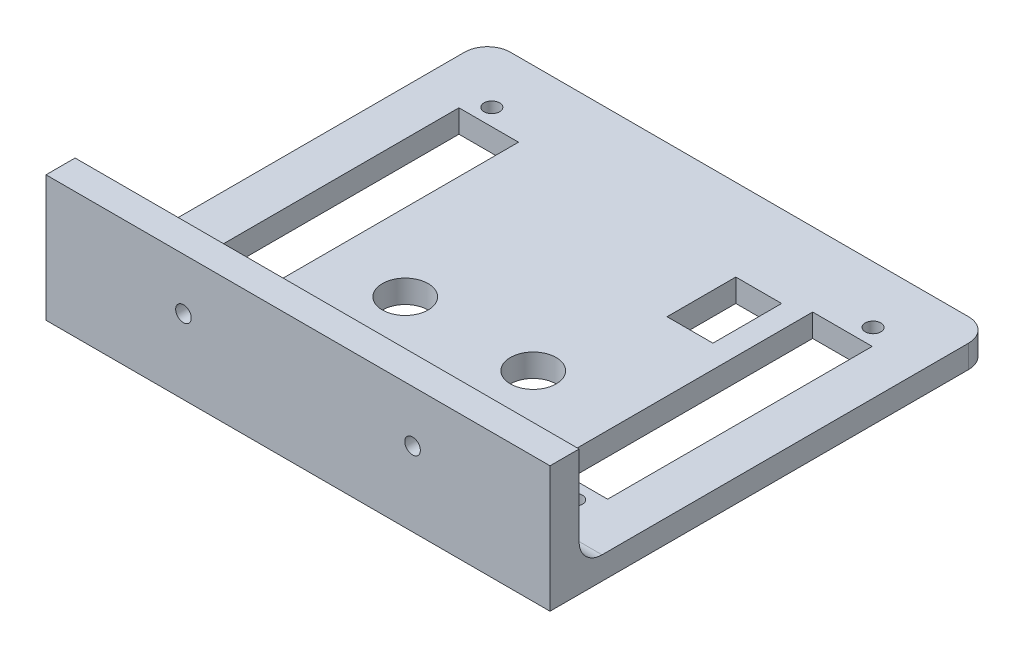
ISO-10303-21;
HEADER;
FILE_DESCRIPTION(('STEP AP214'),'2;1');
FILE_NAME('part.step','',(''),(''),'','','');
FILE_SCHEMA(('AUTOMOTIVE_DESIGN { 1 0 10303 214 1 1 1 1 }'));
ENDSEC;
DATA;
#1=APPLICATION_CONTEXT('core data for automotive mechanical design processes');
#2=APPLICATION_PROTOCOL_DEFINITION('international standard','automotive_design',2000,#1);
#3=PRODUCT_CONTEXT('',#1,'mechanical');
#4=PRODUCT('Part','Part','',(#3));
#5=PRODUCT_RELATED_PRODUCT_CATEGORY('part','',(#4));
#6=PRODUCT_DEFINITION_FORMATION('','',#4);
#7=PRODUCT_DEFINITION_CONTEXT('part definition',#1,'design');
#8=PRODUCT_DEFINITION('design','',#6,#7);
#9=PRODUCT_DEFINITION_SHAPE('','',#8);
#10=(LENGTH_UNIT() NAMED_UNIT(*) SI_UNIT(.MILLI.,.METRE.));
#11=(NAMED_UNIT(*) PLANE_ANGLE_UNIT() SI_UNIT($,.RADIAN.));
#12=(NAMED_UNIT(*) SI_UNIT($,.STERADIAN.) SOLID_ANGLE_UNIT());
#13=UNCERTAINTY_MEASURE_WITH_UNIT(LENGTH_MEASURE(1.E-05),#10,'distance_accuracy_value','');
#14=(GEOMETRIC_REPRESENTATION_CONTEXT(3) GLOBAL_UNCERTAINTY_ASSIGNED_CONTEXT((#13)) GLOBAL_UNIT_ASSIGNED_CONTEXT((#10,
#11,#12)) REPRESENTATION_CONTEXT('',''));
#15=CARTESIAN_POINT('',(0.,0.,0.));
#16=DIRECTION('',(0.,0.,1.));
#17=DIRECTION('',(1.,0.,0.));
#18=AXIS2_PLACEMENT_3D('',#15,#16,#17);
#19=CARTESIAN_POINT('',(0.,2.5,0.));
#20=DIRECTION('',(1.,0.,0.));
#21=DIRECTION('',(0.,0.,-1.));
#22=AXIS2_PLACEMENT_3D('',#19,#20,#21);
#23=PLANE('',#22);
#24=DIRECTION('',(0.,0.,1.));
#25=VECTOR('',#24,1.);
#26=CARTESIAN_POINT('',(0.,2.5,0.));
#27=LINE('',#26,#25);
#28=CARTESIAN_POINT('',(0.,2.5,5.));
#29=VERTEX_POINT('',#28);
#30=CARTESIAN_POINT('',(0.,2.5,85.));
#31=VERTEX_POINT('',#30);
#32=EDGE_CURVE('E374',#29,#31,#27,.T.);
#33=ORIENTED_EDGE('',*,*,#32,.F.);
#34=DIRECTION('',(0.,-1.,0.));
#35=VECTOR('',#34,1.);
#36=CARTESIAN_POINT('',(0.,2.5,5.));
#37=LINE('',#36,#35);
#38=CARTESIAN_POINT('',(0.,-2.5,5.));
#39=VERTEX_POINT('',#38);
#40=EDGE_CURVE('E407',#29,#39,#37,.T.);
#41=ORIENTED_EDGE('',*,*,#40,.T.);
#42=DIRECTION('',(0.,0.,1.));
#43=VECTOR('',#42,1.);
#44=CARTESIAN_POINT('',(0.,-2.5,0.));
#45=LINE('',#44,#43);
#46=CARTESIAN_POINT('',(0.,-2.5,96.35));
#47=VERTEX_POINT('',#46);
#48=EDGE_CURVE('E373',#39,#47,#45,.T.);
#49=ORIENTED_EDGE('',*,*,#48,.T.);
#50=DIRECTION('',(0.,1.,0.));
#51=VECTOR('',#50,1.);
#52=CARTESIAN_POINT('',(0.,-112.683131649087,96.35));
#53=LINE('',#52,#51);
#54=CARTESIAN_POINT('',(0.,25.,96.35));
#55=VERTEX_POINT('',#54);
#56=EDGE_CURVE('E338',#47,#55,#53,.T.);
#57=ORIENTED_EDGE('',*,*,#56,.T.);
#58=DIRECTION('',(0.,0.,1.));
#59=VECTOR('',#58,1.);
#60=CARTESIAN_POINT('',(0.,25.,90.));
#61=LINE('',#60,#59);
#62=CARTESIAN_POINT('',(0.,25.,90.));
#63=VERTEX_POINT('',#62);
#64=EDGE_CURVE('E326',#63,#55,#61,.T.);
#65=ORIENTED_EDGE('',*,*,#64,.F.);
#66=DIRECTION('',(0.,1.,0.));
#67=VECTOR('',#66,1.);
#68=CARTESIAN_POINT('',(0.,-112.683131649087,90.));
#69=LINE('',#68,#67);
#70=CARTESIAN_POINT('',(0.,7.50000000000001,90.));
#71=VERTEX_POINT('',#70);
#72=EDGE_CURVE('E339',#71,#63,#69,.T.);
#73=ORIENTED_EDGE('',*,*,#72,.F.);
#74=CARTESIAN_POINT('',(0.,7.5,85.));
#75=DIRECTION('',(1.,0.,0.));
#76=DIRECTION('',(0.,0.,-1.));
#77=AXIS2_PLACEMENT_3D('',#74,#75,#76);
#78=CIRCLE('',#77,5.);
#79=EDGE_CURVE('E11',#71,#31,#78,.T.);
#80=ORIENTED_EDGE('',*,*,#79,.T.);
#81=EDGE_LOOP('',(#33,#41,#49,#57,#65,#73,#80));
#82=FACE_BOUND('',#81,.T.);
#83=ADVANCED_FACE('F39',(#82),#23,.F.);
#84=CARTESIAN_POINT('',(110.,2.5,0.));
#85=DIRECTION('',(-1.,0.,0.));
#86=DIRECTION('',(0.,0.,1.));
#87=AXIS2_PLACEMENT_3D('',#84,#85,#86);
#88=PLANE('',#87);
#89=DIRECTION('',(0.,0.,-1.));
#90=VECTOR('',#89,1.);
#91=CARTESIAN_POINT('',(110.,-2.5,0.));
#92=LINE('',#91,#90);
#93=CARTESIAN_POINT('',(110.,-2.5,96.35));
#94=VERTEX_POINT('',#93);
#95=CARTESIAN_POINT('',(110.,-2.5,5.));
#96=VERTEX_POINT('',#95);
#97=EDGE_CURVE('E385',#94,#96,#92,.T.);
#98=ORIENTED_EDGE('',*,*,#97,.T.);
#99=DIRECTION('',(0.,-1.,0.));
#100=VECTOR('',#99,1.);
#101=CARTESIAN_POINT('',(110.,2.5,5.));
#102=LINE('',#101,#100);
#103=CARTESIAN_POINT('',(110.,2.5,5.));
#104=VERTEX_POINT('',#103);
#105=EDGE_CURVE('E398',#96,#104,#102,.F.);
#106=ORIENTED_EDGE('',*,*,#105,.T.);
#107=DIRECTION('',(0.,0.,-1.));
#108=VECTOR('',#107,1.);
#109=CARTESIAN_POINT('',(110.,2.5,0.));
#110=LINE('',#109,#108);
#111=CARTESIAN_POINT('',(110.,2.5,85.));
#112=VERTEX_POINT('',#111);
#113=EDGE_CURVE('E376',#112,#104,#110,.T.);
#114=ORIENTED_EDGE('',*,*,#113,.F.);
#115=CARTESIAN_POINT('',(110.,7.5,85.));
#116=DIRECTION('',(-1.,0.,0.));
#117=DIRECTION('',(0.,0.,1.));
#118=AXIS2_PLACEMENT_3D('',#115,#116,#117);
#119=CIRCLE('',#118,5.);
#120=CARTESIAN_POINT('',(110.,7.50000000000001,90.));
#121=VERTEX_POINT('',#120);
#122=EDGE_CURVE('E47',#112,#121,#119,.T.);
#123=ORIENTED_EDGE('',*,*,#122,.T.);
#124=DIRECTION('',(0.,1.,0.));
#125=VECTOR('',#124,1.);
#126=CARTESIAN_POINT('',(110.,-112.683131649087,90.));
#127=LINE('',#126,#125);
#128=CARTESIAN_POINT('',(110.,25.,90.));
#129=VERTEX_POINT('',#128);
#130=EDGE_CURVE('E342',#121,#129,#127,.T.);
#131=ORIENTED_EDGE('',*,*,#130,.T.);
#132=DIRECTION('',(0.,0.,-1.));
#133=VECTOR('',#132,1.);
#134=CARTESIAN_POINT('',(110.,25.,90.));
#135=LINE('',#134,#133);
#136=CARTESIAN_POINT('',(110.,25.,96.35));
#137=VERTEX_POINT('',#136);
#138=EDGE_CURVE('E332',#137,#129,#135,.T.);
#139=ORIENTED_EDGE('',*,*,#138,.F.);
#140=DIRECTION('',(0.,1.,0.));
#141=VECTOR('',#140,1.);
#142=CARTESIAN_POINT('',(110.,-112.683131649087,96.35));
#143=LINE('',#142,#141);
#144=EDGE_CURVE('E344',#94,#137,#143,.T.);
#145=ORIENTED_EDGE('',*,*,#144,.F.);
#146=EDGE_LOOP('',(#98,#106,#114,#123,#131,#139,#145));
#147=FACE_BOUND('',#146,.T.);
#148=ADVANCED_FACE('F412',(#147),#88,.F.);
#149=CARTESIAN_POINT('',(0.,2.5,0.));
#150=DIRECTION('',(0.,0.,1.));
#151=DIRECTION('',(1.,0.,0.));
#152=AXIS2_PLACEMENT_3D('',#149,#150,#151);
#153=PLANE('',#152);
#154=DIRECTION('',(-1.,0.,0.));
#155=VECTOR('',#154,1.);
#156=CARTESIAN_POINT('',(0.,2.5,0.));
#157=LINE('',#156,#155);
#158=CARTESIAN_POINT('',(105.,2.5,0.));
#159=VERTEX_POINT('',#158);
#160=CARTESIAN_POINT('',(5.,2.5,0.));
#161=VERTEX_POINT('',#160);
#162=EDGE_CURVE('E380',#159,#161,#157,.T.);
#163=ORIENTED_EDGE('',*,*,#162,.F.);
#164=DIRECTION('',(0.,-1.,0.));
#165=VECTOR('',#164,1.);
#166=CARTESIAN_POINT('',(105.,2.5,0.));
#167=LINE('',#166,#165);
#168=CARTESIAN_POINT('',(105.,-2.5,0.));
#169=VERTEX_POINT('',#168);
#170=EDGE_CURVE('E391',#159,#169,#167,.T.);
#171=ORIENTED_EDGE('',*,*,#170,.T.);
#172=DIRECTION('',(-1.,0.,0.));
#173=VECTOR('',#172,1.);
#174=CARTESIAN_POINT('',(0.,-2.5,0.));
#175=LINE('',#174,#173);
#176=CARTESIAN_POINT('',(5.,-2.5,0.));
#177=VERTEX_POINT('',#176);
#178=EDGE_CURVE('E377',#169,#177,#175,.T.);
#179=ORIENTED_EDGE('',*,*,#178,.T.);
#180=DIRECTION('',(0.,-1.,0.));
#181=VECTOR('',#180,1.);
#182=CARTESIAN_POINT('',(5.,2.5,0.));
#183=LINE('',#182,#181);
#184=EDGE_CURVE('E383',#177,#161,#183,.F.);
#185=ORIENTED_EDGE('',*,*,#184,.T.);
#186=EDGE_LOOP('',(#163,#171,#179,#185));
#187=FACE_BOUND('',#186,.T.);
#188=ADVANCED_FACE('F433',(#187),#153,.F.);
#189=CARTESIAN_POINT('',(0.,2.5,0.));
#190=DIRECTION('',(0.,1.,0.));
#191=DIRECTION('',(0.,0.,1.));
#192=AXIS2_PLACEMENT_3D('',#189,#190,#191);
#193=PLANE('',#192);
#194=DIRECTION('',(-1.,0.,0.));
#195=VECTOR('',#194,1.);
#196=CARTESIAN_POINT('',(9.89999999999999,2.5,16.1261640798226));
#197=LINE('',#196,#195);
#198=CARTESIAN_POINT('',(22.9,2.5,16.1261640798226));
#199=VERTEX_POINT('',#198);
#200=CARTESIAN_POINT('',(9.89999999999999,2.5,16.1261640798226));
#201=VERTEX_POINT('',#200);
#202=EDGE_CURVE('E285',#199,#201,#197,.T.);
#203=ORIENTED_EDGE('',*,*,#202,.F.);
#204=DIRECTION('',(0.,0.,-1.));
#205=VECTOR('',#204,1.);
#206=CARTESIAN_POINT('',(22.9,2.5,16.1261640798226));
#207=LINE('',#206,#205);
#208=CARTESIAN_POINT('',(22.9,2.5,73.8738359201774));
#209=VERTEX_POINT('',#208);
#210=EDGE_CURVE('E208',#209,#199,#207,.T.);
#211=ORIENTED_EDGE('',*,*,#210,.F.);
#212=DIRECTION('',(1.,0.,0.));
#213=VECTOR('',#212,1.);
#214=CARTESIAN_POINT('',(17.9,2.5,73.8738359201774));
#215=LINE('',#214,#213);
#216=CARTESIAN_POINT('',(9.90000000000001,2.5,73.8738359201774));
#217=VERTEX_POINT('',#216);
#218=EDGE_CURVE('E199',#217,#209,#215,.T.);
#219=ORIENTED_EDGE('',*,*,#218,.F.);
#220=DIRECTION('',(0.,0.,1.));
#221=VECTOR('',#220,1.);
#222=CARTESIAN_POINT('',(9.90000000000001,2.5,73.8738359201774));
#223=LINE('',#222,#221);
#224=EDGE_CURVE('E288',#201,#217,#223,.T.);
#225=ORIENTED_EDGE('',*,*,#224,.F.);
#226=EDGE_LOOP('',(#203,#211,#219,#225));
#227=FACE_BOUND('',#226,.T.);
#228=DIRECTION('',(1.,0.,0.));
#229=VECTOR('',#228,1.);
#230=CARTESIAN_POINT('',(100.1,2.5,73.8738359201774));
#231=LINE('',#230,#229);
#232=CARTESIAN_POINT('',(87.1,2.5,73.8738359201774));
#233=VERTEX_POINT('',#232);
#234=CARTESIAN_POINT('',(100.1,2.5,73.8738359201774));
#235=VERTEX_POINT('',#234);
#236=EDGE_CURVE('E274',#233,#235,#231,.T.);
#237=ORIENTED_EDGE('',*,*,#236,.F.);
#238=DIRECTION('',(0.,0.,1.));
#239=VECTOR('',#238,1.);
#240=CARTESIAN_POINT('',(87.1,2.5,16.1261640798226));
#241=LINE('',#240,#239);
#242=CARTESIAN_POINT('',(87.1,2.5,16.1261640798226));
#243=VERTEX_POINT('',#242);
#244=EDGE_CURVE('E210',#243,#233,#241,.T.);
#245=ORIENTED_EDGE('',*,*,#244,.F.);
#246=DIRECTION('',(-1.,0.,0.));
#247=VECTOR('',#246,1.);
#248=CARTESIAN_POINT('',(92.1,2.5,16.1261640798226));
#249=LINE('',#248,#247);
#250=CARTESIAN_POINT('',(100.1,2.5,16.1261640798226));
#251=VERTEX_POINT('',#250);
#252=EDGE_CURVE('E283',#251,#243,#249,.T.);
#253=ORIENTED_EDGE('',*,*,#252,.F.);
#254=DIRECTION('',(0.,0.,-1.));
#255=VECTOR('',#254,1.);
#256=CARTESIAN_POINT('',(100.1,2.5,16.1261640798226));
#257=LINE('',#256,#255);
#258=EDGE_CURVE('E263',#235,#251,#257,.T.);
#259=ORIENTED_EDGE('',*,*,#258,.F.);
#260=EDGE_LOOP('',(#237,#245,#253,#259));
#261=FACE_BOUND('',#260,.T.);
#262=CARTESIAN_POINT('',(96.6,2.5,12.44245));
#263=DIRECTION('',(0.,1.,0.));
#264=DIRECTION('',(0.,0.,1.));
#265=AXIS2_PLACEMENT_3D('',#262,#263,#264);
#266=CIRCLE('',#265,1.69999999999999);
#267=CARTESIAN_POINT('',(96.6,2.5,14.14245));
#268=VERTEX_POINT('',#267);
#269=EDGE_CURVE('E349',#268,#268,#266,.T.);
#270=ORIENTED_EDGE('',*,*,#269,.F.);
#271=EDGE_LOOP('',(#270));
#272=FACE_BOUND('',#271,.T.);
#273=CARTESIAN_POINT('',(96.6,2.5,77.55755));
#274=DIRECTION('',(0.,1.,0.));
#275=DIRECTION('',(0.,0.,1.));
#276=AXIS2_PLACEMENT_3D('',#273,#274,#275);
#277=CIRCLE('',#276,1.69999999999999);
#278=CARTESIAN_POINT('',(96.6,2.5,79.25755));
#279=VERTEX_POINT('',#278);
#280=EDGE_CURVE('E355',#279,#279,#277,.T.);
#281=ORIENTED_EDGE('',*,*,#280,.F.);
#282=EDGE_LOOP('',(#281));
#283=FACE_BOUND('',#282,.T.);
#284=CARTESIAN_POINT('',(13.4,2.5,12.44245));
#285=DIRECTION('',(0.,1.,0.));
#286=DIRECTION('',(0.,0.,1.));
#287=AXIS2_PLACEMENT_3D('',#284,#285,#286);
#288=CIRCLE('',#287,1.7);
#289=CARTESIAN_POINT('',(13.4,2.5,14.14245));
#290=VERTEX_POINT('',#289);
#291=EDGE_CURVE('E361',#290,#290,#288,.T.);
#292=ORIENTED_EDGE('',*,*,#291,.F.);
#293=EDGE_LOOP('',(#292));
#294=FACE_BOUND('',#293,.T.);
#295=CARTESIAN_POINT('',(13.4,2.5,77.55755));
#296=DIRECTION('',(0.,1.,0.));
#297=DIRECTION('',(0.,0.,1.));
#298=AXIS2_PLACEMENT_3D('',#295,#296,#297);
#299=CIRCLE('',#298,1.7);
#300=CARTESIAN_POINT('',(13.4,2.5,79.25755));
#301=VERTEX_POINT('',#300);
#302=EDGE_CURVE('E367',#301,#301,#299,.T.);
#303=ORIENTED_EDGE('',*,*,#302,.F.);
#304=EDGE_LOOP('',(#303));
#305=FACE_BOUND('',#304,.T.);
#306=ORIENTED_EDGE('',*,*,#113,.T.);
#307=CARTESIAN_POINT('',(105.,2.5,5.));
#308=DIRECTION('',(0.,1.,0.));
#309=DIRECTION('',(0.,0.,1.));
#310=AXIS2_PLACEMENT_3D('',#307,#308,#309);
#311=CIRCLE('',#310,5.);
#312=EDGE_CURVE('E405',#104,#159,#311,.T.);
#313=ORIENTED_EDGE('',*,*,#312,.T.);
#314=ORIENTED_EDGE('',*,*,#162,.T.);
#315=CARTESIAN_POINT('',(5.,2.5,5.));
#316=DIRECTION('',(0.,1.,0.));
#317=DIRECTION('',(0.,0.,1.));
#318=AXIS2_PLACEMENT_3D('',#315,#316,#317);
#319=CIRCLE('',#318,5.);
#320=EDGE_CURVE('E403',#161,#29,#319,.T.);
#321=ORIENTED_EDGE('',*,*,#320,.T.);
#322=ORIENTED_EDGE('',*,*,#32,.T.);
#323=DIRECTION('',(1.,0.,0.));
#324=VECTOR('',#323,1.);
#325=CARTESIAN_POINT('',(110.,2.5,85.));
#326=LINE('',#325,#324);
#327=EDGE_CURVE('E400',#31,#112,#326,.T.);
#328=ORIENTED_EDGE('',*,*,#327,.T.);
#329=EDGE_LOOP('',(#306,#313,#314,#321,#322,#328));
#330=FACE_BOUND('',#329,.T.);
#331=CARTESIAN_POINT('',(67.7,2.5,57.70755));
#332=DIRECTION('',(0.,1.,0.));
#333=DIRECTION('',(0.,0.,1.));
#334=AXIS2_PLACEMENT_3D('',#331,#332,#333);
#335=CIRCLE('',#334,5.00000000000001);
#336=CARTESIAN_POINT('',(67.7,2.5,62.70755));
#337=VERTEX_POINT('',#336);
#338=EDGE_CURVE('E213',#337,#337,#335,.T.);
#339=ORIENTED_EDGE('',*,*,#338,.F.);
#340=EDGE_LOOP('',(#339));
#341=FACE_BOUND('',#340,.T.);
#342=CARTESIAN_POINT('',(39.76,2.5,57.70755));
#343=DIRECTION('',(0.,1.,0.));
#344=DIRECTION('',(0.,0.,1.));
#345=AXIS2_PLACEMENT_3D('',#342,#343,#344);
#346=CIRCLE('',#345,5.);
#347=CARTESIAN_POINT('',(39.76,2.5,62.70755));
#348=VERTEX_POINT('',#347);
#349=EDGE_CURVE('E229',#348,#348,#346,.T.);
#350=ORIENTED_EDGE('',*,*,#349,.F.);
#351=EDGE_LOOP('',(#350));
#352=FACE_BOUND('',#351,.T.);
#353=DIRECTION('',(0.,0.,1.));
#354=VECTOR('',#353,1.);
#355=CARTESIAN_POINT('',(72.1,2.5,17.9));
#356=LINE('',#355,#354);
#357=CARTESIAN_POINT('',(72.1,2.5,17.9));
#358=VERTEX_POINT('',#357);
#359=CARTESIAN_POINT('',(72.1,2.5,32.9));
#360=VERTEX_POINT('',#359);
#361=EDGE_CURVE('E235',#358,#360,#356,.T.);
#362=ORIENTED_EDGE('',*,*,#361,.F.);
#363=DIRECTION('',(-1.,0.,0.));
#364=VECTOR('',#363,1.);
#365=CARTESIAN_POINT('',(72.1,2.5,17.9));
#366=LINE('',#365,#364);
#367=CARTESIAN_POINT('',(82.1,2.5,17.9));
#368=VERTEX_POINT('',#367);
#369=EDGE_CURVE('E242',#368,#358,#366,.T.);
#370=ORIENTED_EDGE('',*,*,#369,.F.);
#371=DIRECTION('',(0.,0.,-1.));
#372=VECTOR('',#371,1.);
#373=CARTESIAN_POINT('',(82.1,2.5,17.9));
#374=LINE('',#373,#372);
#375=CARTESIAN_POINT('',(82.1,2.5,32.9));
#376=VERTEX_POINT('',#375);
#377=EDGE_CURVE('E256',#376,#368,#374,.T.);
#378=ORIENTED_EDGE('',*,*,#377,.F.);
#379=DIRECTION('',(1.,0.,0.));
#380=VECTOR('',#379,1.);
#381=CARTESIAN_POINT('',(72.1,2.5,32.9));
#382=LINE('',#381,#380);
#383=EDGE_CURVE('E253',#360,#376,#382,.T.);
#384=ORIENTED_EDGE('',*,*,#383,.F.);
#385=EDGE_LOOP('',(#362,#370,#378,#384));
#386=FACE_BOUND('',#385,.T.);
#387=ADVANCED_FACE('F419',(#227,#261,#272,#283,#294,#305,#330,#341,#352,#386),#193,.T.);
#388=CARTESIAN_POINT('',(0.,-2.5,0.));
#389=DIRECTION('',(0.,1.,0.));
#390=DIRECTION('',(0.,0.,1.));
#391=AXIS2_PLACEMENT_3D('',#388,#389,#390);
#392=PLANE('',#391);
#393=DIRECTION('',(0.,0.,1.));
#394=VECTOR('',#393,1.);
#395=CARTESIAN_POINT('',(87.1,-2.5,16.1261640798226));
#396=LINE('',#395,#394);
#397=CARTESIAN_POINT('',(87.1,-2.5,16.1261640798226));
#398=VERTEX_POINT('',#397);
#399=CARTESIAN_POINT('',(87.1,-2.5,73.8738359201774));
#400=VERTEX_POINT('',#399);
#401=EDGE_CURVE('E218',#398,#400,#396,.T.);
#402=ORIENTED_EDGE('',*,*,#401,.T.);
#403=DIRECTION('',(1.,0.,0.));
#404=VECTOR('',#403,1.);
#405=CARTESIAN_POINT('',(100.1,-2.5,73.8738359201774));
#406=LINE('',#405,#404);
#407=CARTESIAN_POINT('',(100.1,-2.5,73.8738359201774));
#408=VERTEX_POINT('',#407);
#409=EDGE_CURVE('E193',#400,#408,#406,.T.);
#410=ORIENTED_EDGE('',*,*,#409,.T.);
#411=DIRECTION('',(0.,0.,-1.));
#412=VECTOR('',#411,1.);
#413=CARTESIAN_POINT('',(100.1,-2.5,16.1261640798226));
#414=LINE('',#413,#412);
#415=CARTESIAN_POINT('',(100.1,-2.5,16.1261640798226));
#416=VERTEX_POINT('',#415);
#417=EDGE_CURVE('E270',#408,#416,#414,.T.);
#418=ORIENTED_EDGE('',*,*,#417,.T.);
#419=DIRECTION('',(-1.,0.,0.));
#420=VECTOR('',#419,1.);
#421=CARTESIAN_POINT('',(92.1,-2.5,16.1261640798226));
#422=LINE('',#421,#420);
#423=EDGE_CURVE('E273',#416,#398,#422,.T.);
#424=ORIENTED_EDGE('',*,*,#423,.T.);
#425=EDGE_LOOP('',(#402,#410,#418,#424));
#426=FACE_BOUND('',#425,.T.);
#427=DIRECTION('',(0.,0.,-1.));
#428=VECTOR('',#427,1.);
#429=CARTESIAN_POINT('',(22.9,-2.5,16.1261640798226));
#430=LINE('',#429,#428);
#431=CARTESIAN_POINT('',(22.9,-2.5,73.8738359201774));
#432=VERTEX_POINT('',#431);
#433=CARTESIAN_POINT('',(22.9,-2.5,16.1261640798226));
#434=VERTEX_POINT('',#433);
#435=EDGE_CURVE('E189',#432,#434,#430,.T.);
#436=ORIENTED_EDGE('',*,*,#435,.T.);
#437=DIRECTION('',(-1.,0.,0.));
#438=VECTOR('',#437,1.);
#439=CARTESIAN_POINT('',(9.89999999999999,-2.5,16.1261640798226));
#440=LINE('',#439,#438);
#441=CARTESIAN_POINT('',(9.89999999999999,-2.5,16.1261640798226));
#442=VERTEX_POINT('',#441);
#443=EDGE_CURVE('E276',#434,#442,#440,.T.);
#444=ORIENTED_EDGE('',*,*,#443,.T.);
#445=DIRECTION('',(0.,0.,1.));
#446=VECTOR('',#445,1.);
#447=CARTESIAN_POINT('',(9.90000000000001,-2.5,73.8738359201774));
#448=LINE('',#447,#446);
#449=CARTESIAN_POINT('',(9.90000000000001,-2.5,73.8738359201774));
#450=VERTEX_POINT('',#449);
#451=EDGE_CURVE('E191',#442,#450,#448,.T.);
#452=ORIENTED_EDGE('',*,*,#451,.T.);
#453=DIRECTION('',(1.,0.,0.));
#454=VECTOR('',#453,1.);
#455=CARTESIAN_POINT('',(17.9,-2.5,73.8738359201774));
#456=LINE('',#455,#454);
#457=EDGE_CURVE('E183',#450,#432,#456,.T.);
#458=ORIENTED_EDGE('',*,*,#457,.T.);
#459=EDGE_LOOP('',(#436,#444,#452,#458));
#460=FACE_BOUND('',#459,.T.);
#461=CARTESIAN_POINT('',(96.6,-2.5,12.44245));
#462=DIRECTION('',(0.,1.,0.));
#463=DIRECTION('',(0.,0.,1.));
#464=AXIS2_PLACEMENT_3D('',#461,#462,#463);
#465=CIRCLE('',#464,1.69999999999999);
#466=CARTESIAN_POINT('',(96.6,-2.5,14.14245));
#467=VERTEX_POINT('',#466);
#468=EDGE_CURVE('E352',#467,#467,#465,.T.);
#469=ORIENTED_EDGE('',*,*,#468,.T.);
#470=EDGE_LOOP('',(#469));
#471=FACE_BOUND('',#470,.T.);
#472=CARTESIAN_POINT('',(96.6,-2.5,77.55755));
#473=DIRECTION('',(0.,1.,0.));
#474=DIRECTION('',(0.,0.,1.));
#475=AXIS2_PLACEMENT_3D('',#472,#473,#474);
#476=CIRCLE('',#475,1.69999999999999);
#477=CARTESIAN_POINT('',(96.6,-2.5,79.25755));
#478=VERTEX_POINT('',#477);
#479=EDGE_CURVE('E358',#478,#478,#476,.T.);
#480=ORIENTED_EDGE('',*,*,#479,.T.);
#481=EDGE_LOOP('',(#480));
#482=FACE_BOUND('',#481,.T.);
#483=CARTESIAN_POINT('',(13.4,-2.5,12.44245));
#484=DIRECTION('',(0.,1.,0.));
#485=DIRECTION('',(0.,0.,1.));
#486=AXIS2_PLACEMENT_3D('',#483,#484,#485);
#487=CIRCLE('',#486,1.7);
#488=CARTESIAN_POINT('',(13.4,-2.5,14.14245));
#489=VERTEX_POINT('',#488);
#490=EDGE_CURVE('E364',#489,#489,#487,.T.);
#491=ORIENTED_EDGE('',*,*,#490,.T.);
#492=EDGE_LOOP('',(#491));
#493=FACE_BOUND('',#492,.T.);
#494=CARTESIAN_POINT('',(13.4,-2.5,77.55755));
#495=DIRECTION('',(0.,1.,0.));
#496=DIRECTION('',(0.,0.,1.));
#497=AXIS2_PLACEMENT_3D('',#494,#495,#496);
#498=CIRCLE('',#497,1.7);
#499=CARTESIAN_POINT('',(13.4,-2.5,79.25755));
#500=VERTEX_POINT('',#499);
#501=EDGE_CURVE('E370',#500,#500,#498,.T.);
#502=ORIENTED_EDGE('',*,*,#501,.T.);
#503=EDGE_LOOP('',(#502));
#504=FACE_BOUND('',#503,.T.);
#505=ORIENTED_EDGE('',*,*,#178,.F.);
#506=CARTESIAN_POINT('',(105.,-2.5,5.));
#507=DIRECTION('',(0.,1.,0.));
#508=DIRECTION('',(0.,0.,1.));
#509=AXIS2_PLACEMENT_3D('',#506,#507,#508);
#510=CIRCLE('',#509,5.);
#511=EDGE_CURVE('E396',#169,#96,#510,.F.);
#512=ORIENTED_EDGE('',*,*,#511,.T.);
#513=ORIENTED_EDGE('',*,*,#97,.F.);
#514=DIRECTION('',(-1.,0.,0.));
#515=VECTOR('',#514,1.);
#516=CARTESIAN_POINT('',(0.,-2.5,96.35));
#517=LINE('',#516,#515);
#518=EDGE_CURVE('E341',#94,#47,#517,.T.);
#519=ORIENTED_EDGE('',*,*,#518,.T.);
#520=ORIENTED_EDGE('',*,*,#48,.F.);
#521=CARTESIAN_POINT('',(5.,-2.5,5.));
#522=DIRECTION('',(0.,1.,0.));
#523=DIRECTION('',(0.,0.,1.));
#524=AXIS2_PLACEMENT_3D('',#521,#522,#523);
#525=CIRCLE('',#524,5.);
#526=EDGE_CURVE('E394',#39,#177,#525,.F.);
#527=ORIENTED_EDGE('',*,*,#526,.T.);
#528=EDGE_LOOP('',(#505,#512,#513,#519,#520,#527));
#529=FACE_BOUND('',#528,.T.);
#530=CARTESIAN_POINT('',(67.7,-2.5,57.70755));
#531=DIRECTION('',(0.,1.,0.));
#532=DIRECTION('',(0.,0.,1.));
#533=AXIS2_PLACEMENT_3D('',#530,#531,#532);
#534=CIRCLE('',#533,5.00000000000001);
#535=CARTESIAN_POINT('',(67.7,-2.5,62.70755));
#536=VERTEX_POINT('',#535);
#537=EDGE_CURVE('E226',#536,#536,#534,.T.);
#538=ORIENTED_EDGE('',*,*,#537,.T.);
#539=EDGE_LOOP('',(#538));
#540=FACE_BOUND('',#539,.T.);
#541=CARTESIAN_POINT('',(39.76,-2.5,57.70755));
#542=DIRECTION('',(0.,1.,0.));
#543=DIRECTION('',(0.,0.,1.));
#544=AXIS2_PLACEMENT_3D('',#541,#542,#543);
#545=CIRCLE('',#544,5.);
#546=CARTESIAN_POINT('',(39.76,-2.5,62.70755));
#547=VERTEX_POINT('',#546);
#548=EDGE_CURVE('E232',#547,#547,#545,.T.);
#549=ORIENTED_EDGE('',*,*,#548,.T.);
#550=EDGE_LOOP('',(#549));
#551=FACE_BOUND('',#550,.T.);
#552=DIRECTION('',(-1.,0.,0.));
#553=VECTOR('',#552,1.);
#554=CARTESIAN_POINT('',(72.1,-2.5,17.9));
#555=LINE('',#554,#553);
#556=CARTESIAN_POINT('',(82.1,-2.5,17.9));
#557=VERTEX_POINT('',#556);
#558=CARTESIAN_POINT('',(72.1,-2.5,17.9));
#559=VERTEX_POINT('',#558);
#560=EDGE_CURVE('E248',#557,#559,#555,.T.);
#561=ORIENTED_EDGE('',*,*,#560,.T.);
#562=DIRECTION('',(0.,0.,1.));
#563=VECTOR('',#562,1.);
#564=CARTESIAN_POINT('',(72.1,-2.5,17.9));
#565=LINE('',#564,#563);
#566=CARTESIAN_POINT('',(72.1,-2.5,32.9));
#567=VERTEX_POINT('',#566);
#568=EDGE_CURVE('E238',#559,#567,#565,.T.);
#569=ORIENTED_EDGE('',*,*,#568,.T.);
#570=DIRECTION('',(1.,0.,0.));
#571=VECTOR('',#570,1.);
#572=CARTESIAN_POINT('',(72.1,-2.5,32.9));
#573=LINE('',#572,#571);
#574=CARTESIAN_POINT('',(82.1,-2.5,32.9));
#575=VERTEX_POINT('',#574);
#576=EDGE_CURVE('E241',#567,#575,#573,.T.);
#577=ORIENTED_EDGE('',*,*,#576,.T.);
#578=DIRECTION('',(0.,0.,-1.));
#579=VECTOR('',#578,1.);
#580=CARTESIAN_POINT('',(82.1,-2.5,17.9));
#581=LINE('',#580,#579);
#582=EDGE_CURVE('E245',#575,#557,#581,.T.);
#583=ORIENTED_EDGE('',*,*,#582,.T.);
#584=EDGE_LOOP('',(#561,#569,#577,#583));
#585=FACE_BOUND('',#584,.T.);
#586=ADVANCED_FACE('F185',(#426,#460,#471,#482,#493,#504,#529,#540,#551,#585),#392,.F.);
#587=CARTESIAN_POINT('',(13.4,2.5,77.55755));
#588=DIRECTION('',(0.,1.,0.));
#589=DIRECTION('',(0.,0.,1.));
#590=AXIS2_PLACEMENT_3D('',#587,#588,#589);
#591=CYLINDRICAL_SURFACE('',#590,1.7);
#592=ORIENTED_EDGE('',*,*,#501,.F.);
#593=EDGE_LOOP('',(#592));
#594=FACE_BOUND('',#593,.T.);
#595=ORIENTED_EDGE('',*,*,#302,.T.);
#596=EDGE_LOOP('',(#595));
#597=FACE_BOUND('',#596,.T.);
#598=ADVANCED_FACE('F626',(#594,#597),#591,.F.);
#599=CARTESIAN_POINT('',(13.4,2.5,12.44245));
#600=DIRECTION('',(0.,1.,0.));
#601=DIRECTION('',(0.,0.,1.));
#602=AXIS2_PLACEMENT_3D('',#599,#600,#601);
#603=CYLINDRICAL_SURFACE('',#602,1.7);
#604=ORIENTED_EDGE('',*,*,#490,.F.);
#605=EDGE_LOOP('',(#604));
#606=FACE_BOUND('',#605,.T.);
#607=ORIENTED_EDGE('',*,*,#291,.T.);
#608=EDGE_LOOP('',(#607));
#609=FACE_BOUND('',#608,.T.);
#610=ADVANCED_FACE('F681',(#606,#609),#603,.F.);
#611=CARTESIAN_POINT('',(96.6,2.5,77.55755));
#612=DIRECTION('',(0.,1.,0.));
#613=DIRECTION('',(0.,0.,1.));
#614=AXIS2_PLACEMENT_3D('',#611,#612,#613);
#615=CYLINDRICAL_SURFACE('',#614,1.69999999999999);
#616=ORIENTED_EDGE('',*,*,#479,.F.);
#617=EDGE_LOOP('',(#616));
#618=FACE_BOUND('',#617,.T.);
#619=ORIENTED_EDGE('',*,*,#280,.T.);
#620=EDGE_LOOP('',(#619));
#621=FACE_BOUND('',#620,.T.);
#622=ADVANCED_FACE('F670',(#618,#621),#615,.F.);
#623=CARTESIAN_POINT('',(96.6,2.5,12.44245));
#624=DIRECTION('',(0.,1.,0.));
#625=DIRECTION('',(0.,0.,1.));
#626=AXIS2_PLACEMENT_3D('',#623,#624,#625);
#627=CYLINDRICAL_SURFACE('',#626,1.69999999999999);
#628=ORIENTED_EDGE('',*,*,#468,.F.);
#629=EDGE_LOOP('',(#628));
#630=FACE_BOUND('',#629,.T.);
#631=ORIENTED_EDGE('',*,*,#269,.T.);
#632=EDGE_LOOP('',(#631));
#633=FACE_BOUND('',#632,.T.);
#634=ADVANCED_FACE('F665',(#630,#633),#627,.F.);
#635=CARTESIAN_POINT('',(0.,-112.683131649087,90.));
#636=DIRECTION('',(0.,0.,-1.));
#637=DIRECTION('',(-1.,0.,0.));
#638=AXIS2_PLACEMENT_3D('',#635,#636,#637);
#639=PLANE('',#638);
#640=CARTESIAN_POINT('',(30.,13.75,90.));
#641=DIRECTION('',(0.,0.,-1.));
#642=DIRECTION('',(-1.,0.,0.));
#643=AXIS2_PLACEMENT_3D('',#640,#641,#642);
#644=CIRCLE('',#643,3.25);
#645=CARTESIAN_POINT('',(26.75,13.75,90.));
#646=VERTEX_POINT('',#645);
#647=EDGE_CURVE('E296',#646,#646,#644,.T.);
#648=ORIENTED_EDGE('',*,*,#647,.F.);
#649=EDGE_LOOP('',(#648));
#650=FACE_BOUND('',#649,.T.);
#651=CARTESIAN_POINT('',(80.,13.75,90.));
#652=DIRECTION('',(0.,0.,-1.));
#653=DIRECTION('',(-1.,0.,0.));
#654=AXIS2_PLACEMENT_3D('',#651,#652,#653);
#655=CIRCLE('',#654,3.25);
#656=CARTESIAN_POINT('',(76.75,13.75,90.));
#657=VERTEX_POINT('',#656);
#658=EDGE_CURVE('E314',#657,#657,#655,.T.);
#659=ORIENTED_EDGE('',*,*,#658,.F.);
#660=EDGE_LOOP('',(#659));
#661=FACE_BOUND('',#660,.T.);
#662=ORIENTED_EDGE('',*,*,#130,.F.);
#663=DIRECTION('',(1.,0.,0.));
#664=VECTOR('',#663,1.);
#665=CARTESIAN_POINT('',(0.,7.5,90.));
#666=LINE('',#665,#664);
#667=EDGE_CURVE('E54',#121,#71,#666,.F.);
#668=ORIENTED_EDGE('',*,*,#667,.T.);
#669=ORIENTED_EDGE('',*,*,#72,.T.);
#670=DIRECTION('',(-1.,0.,0.));
#671=VECTOR('',#670,1.);
#672=CARTESIAN_POINT('',(0.,25.,90.));
#673=LINE('',#672,#671);
#674=EDGE_CURVE('E335',#129,#63,#673,.T.);
#675=ORIENTED_EDGE('',*,*,#674,.F.);
#676=EDGE_LOOP('',(#662,#668,#669,#675));
#677=FACE_BOUND('',#676,.T.);
#678=ADVANCED_FACE('F417',(#650,#661,#677),#639,.T.);
#679=CARTESIAN_POINT('',(0.,-112.683131649087,96.35));
#680=DIRECTION('',(0.,0.,1.));
#681=DIRECTION('',(1.,0.,0.));
#682=AXIS2_PLACEMENT_3D('',#679,#680,#681);
#683=PLANE('',#682);
#684=CARTESIAN_POINT('',(30.,13.75,96.35));
#685=DIRECTION('',(0.,0.,1.));
#686=DIRECTION('',(1.,0.,0.));
#687=AXIS2_PLACEMENT_3D('',#684,#685,#686);
#688=CIRCLE('',#687,1.7);
#689=CARTESIAN_POINT('',(31.7,13.75,96.35));
#690=VERTEX_POINT('',#689);
#691=EDGE_CURVE('E311',#690,#690,#688,.T.);
#692=ORIENTED_EDGE('',*,*,#691,.F.);
#693=EDGE_LOOP('',(#692));
#694=FACE_BOUND('',#693,.T.);
#695=CARTESIAN_POINT('',(80.,13.75,96.35));
#696=DIRECTION('',(0.,0.,1.));
#697=DIRECTION('',(1.,0.,0.));
#698=AXIS2_PLACEMENT_3D('',#695,#696,#697);
#699=CIRCLE('',#698,1.69999999999999);
#700=CARTESIAN_POINT('',(81.7,13.75,96.35));
#701=VERTEX_POINT('',#700);
#702=EDGE_CURVE('E323',#701,#701,#699,.T.);
#703=ORIENTED_EDGE('',*,*,#702,.F.);
#704=EDGE_LOOP('',(#703));
#705=FACE_BOUND('',#704,.T.);
#706=ORIENTED_EDGE('',*,*,#518,.F.);
#707=ORIENTED_EDGE('',*,*,#144,.T.);
#708=DIRECTION('',(1.,0.,0.));
#709=VECTOR('',#708,1.);
#710=CARTESIAN_POINT('',(0.,25.,96.35));
#711=LINE('',#710,#709);
#712=EDGE_CURVE('E329',#55,#137,#711,.T.);
#713=ORIENTED_EDGE('',*,*,#712,.F.);
#714=ORIENTED_EDGE('',*,*,#56,.F.);
#715=EDGE_LOOP('',(#706,#707,#713,#714));
#716=FACE_BOUND('',#715,.T.);
#717=ADVANCED_FACE('F443',(#694,#705,#716),#683,.T.);
#718=CARTESIAN_POINT('',(0.,25.,0.));
#719=DIRECTION('',(0.,1.,0.));
#720=DIRECTION('',(0.,0.,1.));
#721=AXIS2_PLACEMENT_3D('',#718,#719,#720);
#722=PLANE('',#721);
#723=ORIENTED_EDGE('',*,*,#64,.T.);
#724=ORIENTED_EDGE('',*,*,#712,.T.);
#725=ORIENTED_EDGE('',*,*,#138,.T.);
#726=ORIENTED_EDGE('',*,*,#674,.T.);
#727=EDGE_LOOP('',(#723,#724,#725,#726));
#728=FACE_BOUND('',#727,.T.);
#729=ADVANCED_FACE('F446',(#728),#722,.T.);
#730=CARTESIAN_POINT('',(80.,13.75,90.));
#731=DIRECTION('',(0.,0.,-1.));
#732=DIRECTION('',(-1.,0.,0.));
#733=AXIS2_PLACEMENT_3D('',#730,#731,#732);
#734=CYLINDRICAL_SURFACE('',#733,1.69999999999999);
#735=CARTESIAN_POINT('',(80.,13.75,93.));
#736=DIRECTION('',(0.,0.,-1.));
#737=DIRECTION('',(-1.,0.,0.));
#738=AXIS2_PLACEMENT_3D('',#735,#736,#737);
#739=CIRCLE('',#738,1.69999999999999);
#740=CARTESIAN_POINT('',(78.3,13.75,93.));
#741=VERTEX_POINT('',#740);
#742=EDGE_CURVE('E320',#741,#741,#739,.T.);
#743=ORIENTED_EDGE('',*,*,#742,.T.);
#744=EDGE_LOOP('',(#743));
#745=FACE_BOUND('',#744,.T.);
#746=ORIENTED_EDGE('',*,*,#702,.T.);
#747=EDGE_LOOP('',(#746));
#748=FACE_BOUND('',#747,.T.);
#749=ADVANCED_FACE('F448',(#745,#748),#734,.F.);
#750=CARTESIAN_POINT('',(81.7,13.75,93.));
#751=DIRECTION('',(0.,0.,1.));
#752=DIRECTION('',(1.,0.,0.));
#753=AXIS2_PLACEMENT_3D('',#750,#751,#752);
#754=PLANE('',#753);
#755=ORIENTED_EDGE('',*,*,#742,.F.);
#756=EDGE_LOOP('',(#755));
#757=FACE_BOUND('',#756,.T.);
#758=CARTESIAN_POINT('',(80.,13.75,93.));
#759=DIRECTION('',(0.,0.,-1.));
#760=DIRECTION('',(-1.,0.,0.));
#761=AXIS2_PLACEMENT_3D('',#758,#759,#760);
#762=CIRCLE('',#761,3.25);
#763=CARTESIAN_POINT('',(76.75,13.75,93.));
#764=VERTEX_POINT('',#763);
#765=EDGE_CURVE('E317',#764,#764,#762,.T.);
#766=ORIENTED_EDGE('',*,*,#765,.T.);
#767=EDGE_LOOP('',(#766));
#768=FACE_BOUND('',#767,.T.);
#769=ADVANCED_FACE('F455',(#757,#768),#754,.F.);
#770=CARTESIAN_POINT('',(80.,13.75,90.));
#771=DIRECTION('',(0.,0.,-1.));
#772=DIRECTION('',(-1.,0.,0.));
#773=AXIS2_PLACEMENT_3D('',#770,#771,#772);
#774=CYLINDRICAL_SURFACE('',#773,3.25);
#775=ORIENTED_EDGE('',*,*,#765,.F.);
#776=EDGE_LOOP('',(#775));
#777=FACE_BOUND('',#776,.T.);
#778=ORIENTED_EDGE('',*,*,#658,.T.);
#779=EDGE_LOOP('',(#778));
#780=FACE_BOUND('',#779,.T.);
#781=ADVANCED_FACE('F719',(#777,#780),#774,.F.);
#782=CARTESIAN_POINT('',(30.,13.75,90.));
#783=DIRECTION('',(0.,0.,-1.));
#784=DIRECTION('',(-1.,0.,0.));
#785=AXIS2_PLACEMENT_3D('',#782,#783,#784);
#786=CYLINDRICAL_SURFACE('',#785,1.7);
#787=CARTESIAN_POINT('',(30.,13.75,93.));
#788=DIRECTION('',(0.,0.,-1.));
#789=DIRECTION('',(-1.,0.,0.));
#790=AXIS2_PLACEMENT_3D('',#787,#788,#789);
#791=CIRCLE('',#790,1.7);
#792=CARTESIAN_POINT('',(28.3,13.75,93.));
#793=VERTEX_POINT('',#792);
#794=EDGE_CURVE('E308',#793,#793,#791,.T.);
#795=ORIENTED_EDGE('',*,*,#794,.T.);
#796=EDGE_LOOP('',(#795));
#797=FACE_BOUND('',#796,.T.);
#798=ORIENTED_EDGE('',*,*,#691,.T.);
#799=EDGE_LOOP('',(#798));
#800=FACE_BOUND('',#799,.T.);
#801=ADVANCED_FACE('F721',(#797,#800),#786,.F.);
#802=CARTESIAN_POINT('',(31.7,13.75,93.));
#803=DIRECTION('',(0.,0.,1.));
#804=DIRECTION('',(1.,0.,0.));
#805=AXIS2_PLACEMENT_3D('',#802,#803,#804);
#806=PLANE('',#805);
#807=ORIENTED_EDGE('',*,*,#794,.F.);
#808=EDGE_LOOP('',(#807));
#809=FACE_BOUND('',#808,.T.);
#810=CARTESIAN_POINT('',(30.,13.75,93.));
#811=DIRECTION('',(0.,0.,-1.));
#812=DIRECTION('',(-1.,0.,0.));
#813=AXIS2_PLACEMENT_3D('',#810,#811,#812);
#814=CIRCLE('',#813,3.25);
#815=CARTESIAN_POINT('',(26.75,13.75,93.));
#816=VERTEX_POINT('',#815);
#817=EDGE_CURVE('E305',#816,#816,#814,.T.);
#818=ORIENTED_EDGE('',*,*,#817,.T.);
#819=EDGE_LOOP('',(#818));
#820=FACE_BOUND('',#819,.T.);
#821=ADVANCED_FACE('F728',(#809,#820),#806,.F.);
#822=CARTESIAN_POINT('',(30.,13.75,90.));
#823=DIRECTION('',(0.,0.,-1.));
#824=DIRECTION('',(-1.,0.,0.));
#825=AXIS2_PLACEMENT_3D('',#822,#823,#824);
#826=CYLINDRICAL_SURFACE('',#825,3.25);
#827=ORIENTED_EDGE('',*,*,#817,.F.);
#828=EDGE_LOOP('',(#827));
#829=FACE_BOUND('',#828,.T.);
#830=ORIENTED_EDGE('',*,*,#647,.T.);
#831=EDGE_LOOP('',(#830));
#832=FACE_BOUND('',#831,.T.);
#833=ADVANCED_FACE('F737',(#829,#832),#826,.F.);
#834=CARTESIAN_POINT('',(100.1,-2.5,16.1261640798226));
#835=DIRECTION('',(1.,0.,0.));
#836=DIRECTION('',(0.,0.,-1.));
#837=AXIS2_PLACEMENT_3D('',#834,#835,#836);
#838=PLANE('',#837);
#839=ORIENTED_EDGE('',*,*,#258,.T.);
#840=DIRECTION('',(0.,1.,0.));
#841=VECTOR('',#840,1.);
#842=CARTESIAN_POINT('',(100.1,-2.5,16.1261640798226));
#843=LINE('',#842,#841);
#844=EDGE_CURVE('E281',#416,#251,#843,.T.);
#845=ORIENTED_EDGE('',*,*,#844,.F.);
#846=ORIENTED_EDGE('',*,*,#417,.F.);
#847=DIRECTION('',(0.,1.,0.));
#848=VECTOR('',#847,1.);
#849=CARTESIAN_POINT('',(100.1,-2.5,73.8738359201774));
#850=LINE('',#849,#848);
#851=EDGE_CURVE('E294',#408,#235,#850,.T.);
#852=ORIENTED_EDGE('',*,*,#851,.T.);
#853=EDGE_LOOP('',(#839,#845,#846,#852));
#854=FACE_BOUND('',#853,.T.);
#855=ADVANCED_FACE('F556',(#854),#838,.F.);
#856=CARTESIAN_POINT('',(100.1,-2.5,73.8738359201774));
#857=DIRECTION('',(0.,0.,1.));
#858=DIRECTION('',(1.,0.,0.));
#859=AXIS2_PLACEMENT_3D('',#856,#857,#858);
#860=PLANE('',#859);
#861=ORIENTED_EDGE('',*,*,#236,.T.);
#862=ORIENTED_EDGE('',*,*,#851,.F.);
#863=ORIENTED_EDGE('',*,*,#409,.F.);
#864=DIRECTION('',(0.,1.,0.));
#865=VECTOR('',#864,1.);
#866=CARTESIAN_POINT('',(87.1,-2.5,73.8738359201774));
#867=LINE('',#866,#865);
#868=EDGE_CURVE('E219',#400,#233,#867,.T.);
#869=ORIENTED_EDGE('',*,*,#868,.T.);
#870=EDGE_LOOP('',(#861,#862,#863,#869));
#871=FACE_BOUND('',#870,.T.);
#872=ADVANCED_FACE('F545',(#871),#860,.F.);
#873=CARTESIAN_POINT('',(17.9,-2.5,73.8738359201774));
#874=DIRECTION('',(0.,0.,1.));
#875=DIRECTION('',(1.,0.,0.));
#876=AXIS2_PLACEMENT_3D('',#873,#874,#875);
#877=PLANE('',#876);
#878=ORIENTED_EDGE('',*,*,#218,.T.);
#879=DIRECTION('',(0.,1.,0.));
#880=VECTOR('',#879,1.);
#881=CARTESIAN_POINT('',(22.9,-2.5,73.8738359201774));
#882=LINE('',#881,#880);
#883=EDGE_CURVE('E196',#432,#209,#882,.T.);
#884=ORIENTED_EDGE('',*,*,#883,.F.);
#885=ORIENTED_EDGE('',*,*,#457,.F.);
#886=DIRECTION('',(0.,1.,0.));
#887=VECTOR('',#886,1.);
#888=CARTESIAN_POINT('',(9.90000000000001,-2.5,73.8738359201774));
#889=LINE('',#888,#887);
#890=EDGE_CURVE('E297',#450,#217,#889,.T.);
#891=ORIENTED_EDGE('',*,*,#890,.T.);
#892=EDGE_LOOP('',(#878,#884,#885,#891));
#893=FACE_BOUND('',#892,.T.);
#894=ADVANCED_FACE('F197',(#893),#877,.F.);
#895=CARTESIAN_POINT('',(9.90000000000001,-2.5,73.8738359201774));
#896=DIRECTION('',(-1.,0.,0.));
#897=DIRECTION('',(0.,0.,1.));
#898=AXIS2_PLACEMENT_3D('',#895,#896,#897);
#899=PLANE('',#898);
#900=ORIENTED_EDGE('',*,*,#224,.T.);
#901=ORIENTED_EDGE('',*,*,#890,.F.);
#902=ORIENTED_EDGE('',*,*,#451,.F.);
#903=DIRECTION('',(0.,1.,0.));
#904=VECTOR('',#903,1.);
#905=CARTESIAN_POINT('',(9.89999999999999,-2.5,16.1261640798226));
#906=LINE('',#905,#904);
#907=EDGE_CURVE('E299',#442,#201,#906,.T.);
#908=ORIENTED_EDGE('',*,*,#907,.T.);
#909=EDGE_LOOP('',(#900,#901,#902,#908));
#910=FACE_BOUND('',#909,.T.);
#911=ADVANCED_FACE('F532',(#910),#899,.F.);
#912=CARTESIAN_POINT('',(9.89999999999999,-2.5,16.1261640798226));
#913=DIRECTION('',(0.,0.,-1.));
#914=DIRECTION('',(-1.,0.,0.));
#915=AXIS2_PLACEMENT_3D('',#912,#913,#914);
#916=PLANE('',#915);
#917=ORIENTED_EDGE('',*,*,#202,.T.);
#918=ORIENTED_EDGE('',*,*,#907,.F.);
#919=ORIENTED_EDGE('',*,*,#443,.F.);
#920=DIRECTION('',(0.,1.,0.));
#921=VECTOR('',#920,1.);
#922=CARTESIAN_POINT('',(22.9,-2.5,16.1261640798226));
#923=LINE('',#922,#921);
#924=EDGE_CURVE('E203',#434,#199,#923,.T.);
#925=ORIENTED_EDGE('',*,*,#924,.T.);
#926=EDGE_LOOP('',(#917,#918,#919,#925));
#927=FACE_BOUND('',#926,.T.);
#928=ADVANCED_FACE('F519',(#927),#916,.F.);
#929=CARTESIAN_POINT('',(92.1,-2.5,16.1261640798226));
#930=DIRECTION('',(0.,0.,-1.));
#931=DIRECTION('',(-1.,0.,0.));
#932=AXIS2_PLACEMENT_3D('',#929,#930,#931);
#933=PLANE('',#932);
#934=ORIENTED_EDGE('',*,*,#252,.T.);
#935=DIRECTION('',(0.,1.,0.));
#936=VECTOR('',#935,1.);
#937=CARTESIAN_POINT('',(87.1,-2.5,16.1261640798226));
#938=LINE('',#937,#936);
#939=EDGE_CURVE('E215',#398,#243,#938,.T.);
#940=ORIENTED_EDGE('',*,*,#939,.F.);
#941=ORIENTED_EDGE('',*,*,#423,.F.);
#942=ORIENTED_EDGE('',*,*,#844,.T.);
#943=EDGE_LOOP('',(#934,#940,#941,#942));
#944=FACE_BOUND('',#943,.T.);
#945=ADVANCED_FACE('F513',(#944),#933,.F.);
#946=CARTESIAN_POINT('',(72.1,-2.5,17.9));
#947=DIRECTION('',(-1.,0.,0.));
#948=DIRECTION('',(0.,0.,1.));
#949=AXIS2_PLACEMENT_3D('',#946,#947,#948);
#950=PLANE('',#949);
#951=ORIENTED_EDGE('',*,*,#361,.T.);
#952=DIRECTION('',(0.,1.,0.));
#953=VECTOR('',#952,1.);
#954=CARTESIAN_POINT('',(72.1,-2.5,32.9));
#955=LINE('',#954,#953);
#956=EDGE_CURVE('E251',#567,#360,#955,.T.);
#957=ORIENTED_EDGE('',*,*,#956,.F.);
#958=ORIENTED_EDGE('',*,*,#568,.F.);
#959=DIRECTION('',(0.,1.,0.));
#960=VECTOR('',#959,1.);
#961=CARTESIAN_POINT('',(72.1,-2.5,17.9));
#962=LINE('',#961,#960);
#963=EDGE_CURVE('E261',#559,#358,#962,.T.);
#964=ORIENTED_EDGE('',*,*,#963,.T.);
#965=EDGE_LOOP('',(#951,#957,#958,#964));
#966=FACE_BOUND('',#965,.T.);
#967=ADVANCED_FACE('F518',(#966),#950,.F.);
#968=CARTESIAN_POINT('',(72.1,-2.5,17.9));
#969=DIRECTION('',(0.,0.,-1.));
#970=DIRECTION('',(-1.,0.,0.));
#971=AXIS2_PLACEMENT_3D('',#968,#969,#970);
#972=PLANE('',#971);
#973=ORIENTED_EDGE('',*,*,#369,.T.);
#974=ORIENTED_EDGE('',*,*,#963,.F.);
#975=ORIENTED_EDGE('',*,*,#560,.F.);
#976=DIRECTION('',(0.,1.,0.));
#977=VECTOR('',#976,1.);
#978=CARTESIAN_POINT('',(82.1,-2.5,17.9));
#979=LINE('',#978,#977);
#980=EDGE_CURVE('E264',#557,#368,#979,.T.);
#981=ORIENTED_EDGE('',*,*,#980,.T.);
#982=EDGE_LOOP('',(#973,#974,#975,#981));
#983=FACE_BOUND('',#982,.T.);
#984=ADVANCED_FACE('F598',(#983),#972,.F.);
#985=CARTESIAN_POINT('',(82.1,-2.5,17.9));
#986=DIRECTION('',(1.,0.,0.));
#987=DIRECTION('',(0.,0.,-1.));
#988=AXIS2_PLACEMENT_3D('',#985,#986,#987);
#989=PLANE('',#988);
#990=ORIENTED_EDGE('',*,*,#377,.T.);
#991=ORIENTED_EDGE('',*,*,#980,.F.);
#992=ORIENTED_EDGE('',*,*,#582,.F.);
#993=DIRECTION('',(0.,1.,0.));
#994=VECTOR('',#993,1.);
#995=CARTESIAN_POINT('',(82.1,-2.5,32.9));
#996=LINE('',#995,#994);
#997=EDGE_CURVE('E266',#575,#376,#996,.T.);
#998=ORIENTED_EDGE('',*,*,#997,.T.);
#999=EDGE_LOOP('',(#990,#991,#992,#998));
#1000=FACE_BOUND('',#999,.T.);
#1001=ADVANCED_FACE('F588',(#1000),#989,.F.);
#1002=CARTESIAN_POINT('',(72.1,-2.5,32.9));
#1003=DIRECTION('',(0.,0.,1.));
#1004=DIRECTION('',(1.,0.,0.));
#1005=AXIS2_PLACEMENT_3D('',#1002,#1003,#1004);
#1006=PLANE('',#1005);
#1007=ORIENTED_EDGE('',*,*,#383,.T.);
#1008=ORIENTED_EDGE('',*,*,#997,.F.);
#1009=ORIENTED_EDGE('',*,*,#576,.F.);
#1010=ORIENTED_EDGE('',*,*,#956,.T.);
#1011=EDGE_LOOP('',(#1007,#1008,#1009,#1010));
#1012=FACE_BOUND('',#1011,.T.);
#1013=ADVANCED_FACE('F578',(#1012),#1006,.F.);
#1014=CARTESIAN_POINT('',(39.76,-2.5,57.70755));
#1015=DIRECTION('',(0.,1.,0.));
#1016=DIRECTION('',(0.,0.,1.));
#1017=AXIS2_PLACEMENT_3D('',#1014,#1015,#1016);
#1018=CYLINDRICAL_SURFACE('',#1017,5.);
#1019=ORIENTED_EDGE('',*,*,#548,.F.);
#1020=EDGE_LOOP('',(#1019));
#1021=FACE_BOUND('',#1020,.T.);
#1022=ORIENTED_EDGE('',*,*,#349,.T.);
#1023=EDGE_LOOP('',(#1022));
#1024=FACE_BOUND('',#1023,.T.);
#1025=ADVANCED_FACE('F568',(#1021,#1024),#1018,.F.);
#1026=CARTESIAN_POINT('',(67.7,-2.5,57.70755));
#1027=DIRECTION('',(0.,1.,0.));
#1028=DIRECTION('',(0.,0.,1.));
#1029=AXIS2_PLACEMENT_3D('',#1026,#1027,#1028);
#1030=CYLINDRICAL_SURFACE('',#1029,5.00000000000001);
#1031=ORIENTED_EDGE('',*,*,#537,.F.);
#1032=EDGE_LOOP('',(#1031));
#1033=FACE_BOUND('',#1032,.T.);
#1034=ORIENTED_EDGE('',*,*,#338,.T.);
#1035=EDGE_LOOP('',(#1034));
#1036=FACE_BOUND('',#1035,.T.);
#1037=ADVANCED_FACE('F506',(#1033,#1036),#1030,.F.);
#1038=CARTESIAN_POINT('',(87.1,-2.5,16.1261640798226));
#1039=DIRECTION('',(-1.,0.,0.));
#1040=DIRECTION('',(0.,0.,1.));
#1041=AXIS2_PLACEMENT_3D('',#1038,#1039,#1040);
#1042=PLANE('',#1041);
#1043=ORIENTED_EDGE('',*,*,#244,.T.);
#1044=ORIENTED_EDGE('',*,*,#868,.F.);
#1045=ORIENTED_EDGE('',*,*,#401,.F.);
#1046=ORIENTED_EDGE('',*,*,#939,.T.);
#1047=EDGE_LOOP('',(#1043,#1044,#1045,#1046));
#1048=FACE_BOUND('',#1047,.T.);
#1049=ADVANCED_FACE('F497',(#1048),#1042,.F.);
#1050=CARTESIAN_POINT('',(22.9,-2.5,16.1261640798226));
#1051=DIRECTION('',(1.,0.,0.));
#1052=DIRECTION('',(0.,0.,-1.));
#1053=AXIS2_PLACEMENT_3D('',#1050,#1051,#1052);
#1054=PLANE('',#1053);
#1055=ORIENTED_EDGE('',*,*,#210,.T.);
#1056=ORIENTED_EDGE('',*,*,#924,.F.);
#1057=ORIENTED_EDGE('',*,*,#435,.F.);
#1058=ORIENTED_EDGE('',*,*,#883,.T.);
#1059=EDGE_LOOP('',(#1055,#1056,#1057,#1058));
#1060=FACE_BOUND('',#1059,.T.);
#1061=ADVANCED_FACE('F206',(#1060),#1054,.F.);
#1062=CARTESIAN_POINT('',(105.,2.5,5.));
#1063=DIRECTION('',(0.,-1.,0.));
#1064=DIRECTION('',(0.,0.,-1.));
#1065=AXIS2_PLACEMENT_3D('',#1062,#1063,#1064);
#1066=CYLINDRICAL_SURFACE('',#1065,5.);
#1067=ORIENTED_EDGE('',*,*,#312,.F.);
#1068=ORIENTED_EDGE('',*,*,#105,.F.);
#1069=ORIENTED_EDGE('',*,*,#511,.F.);
#1070=ORIENTED_EDGE('',*,*,#170,.F.);
#1071=EDGE_LOOP('',(#1067,#1068,#1069,#1070));
#1072=FACE_BOUND('',#1071,.T.);
#1073=ADVANCED_FACE('F436',(#1072),#1066,.T.);
#1074=CARTESIAN_POINT('',(5.,2.5,5.));
#1075=DIRECTION('',(0.,-1.,0.));
#1076=DIRECTION('',(0.,0.,-1.));
#1077=AXIS2_PLACEMENT_3D('',#1074,#1075,#1076);
#1078=CYLINDRICAL_SURFACE('',#1077,5.);
#1079=ORIENTED_EDGE('',*,*,#320,.F.);
#1080=ORIENTED_EDGE('',*,*,#184,.F.);
#1081=ORIENTED_EDGE('',*,*,#526,.F.);
#1082=ORIENTED_EDGE('',*,*,#40,.F.);
#1083=EDGE_LOOP('',(#1079,#1080,#1081,#1082));
#1084=FACE_BOUND('',#1083,.T.);
#1085=ADVANCED_FACE('F426',(#1084),#1078,.T.);
#1086=CARTESIAN_POINT('',(0.,7.5,85.));
#1087=DIRECTION('',(-1.,0.,0.));
#1088=DIRECTION('',(0.,0.,1.));
#1089=AXIS2_PLACEMENT_3D('',#1086,#1087,#1088);
#1090=CYLINDRICAL_SURFACE('',#1089,5.);
#1091=ORIENTED_EDGE('',*,*,#79,.F.);
#1092=ORIENTED_EDGE('',*,*,#667,.F.);
#1093=ORIENTED_EDGE('',*,*,#122,.F.);
#1094=ORIENTED_EDGE('',*,*,#327,.F.);
#1095=EDGE_LOOP('',(#1091,#1092,#1093,#1094));
#1096=FACE_BOUND('',#1095,.T.);
#1097=ADVANCED_FACE('F41',(#1096),#1090,.F.);
#1098=CLOSED_SHELL('',(#83,#148,#188,#387,#586,#598,#610,#622,#634,#678,#717,#729,#749,#769,
#781,#801,#821,#833,#855,#872,#894,#911,#928,#945,#967,#984,#1001,#1013,#1025,#1037,#1049,#1061,
#1073,#1085,#1097));
#1099=MANIFOLD_SOLID_BREP('B2',#1098);
#1100=ADVANCED_BREP_SHAPE_REPRESENTATION('',(#18,#1099),#14);
#1101=SHAPE_DEFINITION_REPRESENTATION(#9,#1100);
ENDSEC;
END-ISO-10303-21;
